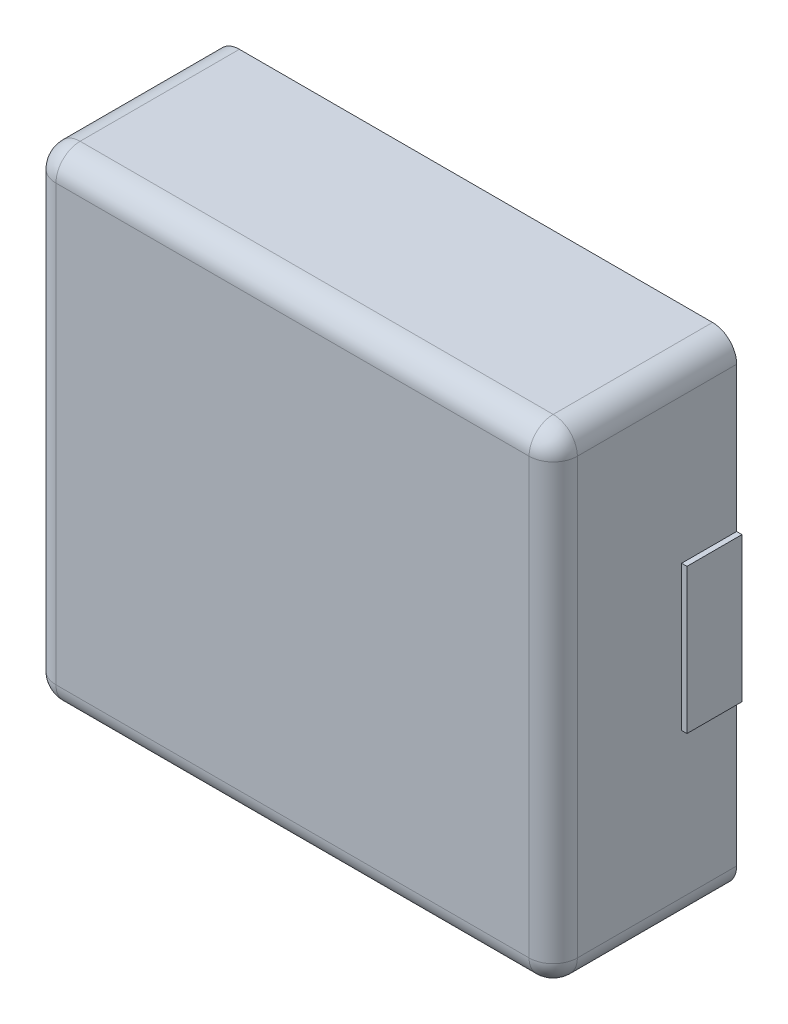
ISO-10303-21;
HEADER;
FILE_DESCRIPTION(('STEP AP214'),'2;1');
FILE_NAME('part.step','',(''),(''),'','','');
FILE_SCHEMA(('AUTOMOTIVE_DESIGN { 1 0 10303 214 1 1 1 1 }'));
ENDSEC;
DATA;
#1=APPLICATION_CONTEXT('core data for automotive mechanical design processes');
#2=APPLICATION_PROTOCOL_DEFINITION('international standard','automotive_design',2000,#1);
#3=PRODUCT_CONTEXT('',#1,'mechanical');
#4=PRODUCT('Part','Part','',(#3));
#5=PRODUCT_RELATED_PRODUCT_CATEGORY('part','',(#4));
#6=PRODUCT_DEFINITION_FORMATION('','',#4);
#7=PRODUCT_DEFINITION_CONTEXT('part definition',#1,'design');
#8=PRODUCT_DEFINITION('design','',#6,#7);
#9=PRODUCT_DEFINITION_SHAPE('','',#8);
#10=(LENGTH_UNIT() NAMED_UNIT(*) SI_UNIT(.MILLI.,.METRE.));
#11=(NAMED_UNIT(*) PLANE_ANGLE_UNIT() SI_UNIT($,.RADIAN.));
#12=(NAMED_UNIT(*) SI_UNIT($,.STERADIAN.) SOLID_ANGLE_UNIT());
#13=UNCERTAINTY_MEASURE_WITH_UNIT(LENGTH_MEASURE(1.E-05),#10,'distance_accuracy_value','');
#14=(GEOMETRIC_REPRESENTATION_CONTEXT(3) GLOBAL_UNCERTAINTY_ASSIGNED_CONTEXT((#13)) GLOBAL_UNIT_ASSIGNED_CONTEXT((#10,
#11,#12)) REPRESENTATION_CONTEXT('',''));
#15=CARTESIAN_POINT('',(0.,0.,0.));
#16=DIRECTION('',(0.,0.,1.));
#17=DIRECTION('',(1.,0.,0.));
#18=AXIS2_PLACEMENT_3D('',#15,#16,#17);
#19=CARTESIAN_POINT('',(4.9,-4.5,3.3));
#20=DIRECTION('',(0.,0.,1.));
#21=DIRECTION('',(1.,0.,0.));
#22=AXIS2_PLACEMENT_3D('',#19,#20,#21);
#23=SPHERICAL_SURFACE('',#22,0.5);
#24=CARTESIAN_POINT('',(4.9,-4.5,3.3));
#25=DIRECTION('',(-1.,0.,0.));
#26=DIRECTION('',(0.,-1.,0.));
#27=AXIS2_PLACEMENT_3D('',#24,#25,#26);
#28=CIRCLE('',#27,0.5);
#29=CARTESIAN_POINT('',(4.9,-5.,3.3));
#30=VERTEX_POINT('',#29);
#31=CARTESIAN_POINT('',(4.9,-4.5,3.8));
#32=VERTEX_POINT('',#31);
#33=EDGE_CURVE('E128',#30,#32,#28,.T.);
#34=ORIENTED_EDGE('',*,*,#33,.F.);
#35=CARTESIAN_POINT('',(4.9,-4.5,3.3));
#36=DIRECTION('',(0.,0.,-1.));
#37=DIRECTION('',(1.,0.,0.));
#38=AXIS2_PLACEMENT_3D('',#35,#36,#37);
#39=CIRCLE('',#38,0.5);
#40=CARTESIAN_POINT('',(5.4,-4.5,3.3));
#41=VERTEX_POINT('',#40);
#42=EDGE_CURVE('E110',#41,#30,#39,.T.);
#43=ORIENTED_EDGE('',*,*,#42,.F.);
#44=CARTESIAN_POINT('',(4.9,-4.5,3.3));
#45=DIRECTION('',(0.,-1.,0.));
#46=DIRECTION('',(1.,0.,0.));
#47=AXIS2_PLACEMENT_3D('',#44,#45,#46);
#48=CIRCLE('',#47,0.5);
#49=EDGE_CURVE('E137',#41,#32,#48,.T.);
#50=ORIENTED_EDGE('',*,*,#49,.T.);
#51=EDGE_LOOP('',(#34,#43,#50));
#52=FACE_BOUND('',#51,.T.);
#53=ADVANCED_FACE('F17',(#52),#23,.T.);
#54=CARTESIAN_POINT('',(5.51,-1.5,0.));
#55=DIRECTION('',(1.,0.,0.));
#56=DIRECTION('',(0.,1.,0.));
#57=AXIS2_PLACEMENT_3D('',#54,#55,#56);
#58=PLANE('',#57);
#59=DIRECTION('',(0.,0.,1.));
#60=VECTOR('',#59,1.);
#61=CARTESIAN_POINT('',(5.51,-1.5,0.));
#62=LINE('',#61,#60);
#63=CARTESIAN_POINT('',(5.51,-1.5,0.));
#64=VERTEX_POINT('',#63);
#65=CARTESIAN_POINT('',(5.51,-1.5,1.14));
#66=VERTEX_POINT('',#65);
#67=EDGE_CURVE('E11',#64,#66,#62,.T.);
#68=ORIENTED_EDGE('',*,*,#67,.F.);
#69=DIRECTION('',(0.,1.,0.));
#70=VECTOR('',#69,1.);
#71=CARTESIAN_POINT('',(5.51,-1.5,0.));
#72=LINE('',#71,#70);
#73=CARTESIAN_POINT('',(5.51,1.5,0.));
#74=VERTEX_POINT('',#73);
#75=EDGE_CURVE('E97',#64,#74,#72,.T.);
#76=ORIENTED_EDGE('',*,*,#75,.T.);
#77=DIRECTION('',(0.,0.,1.));
#78=VECTOR('',#77,1.);
#79=CARTESIAN_POINT('',(5.51,1.5,0.));
#80=LINE('',#79,#78);
#81=CARTESIAN_POINT('',(5.51,1.5,1.14));
#82=VERTEX_POINT('',#81);
#83=EDGE_CURVE('E143',#74,#82,#80,.T.);
#84=ORIENTED_EDGE('',*,*,#83,.T.);
#85=DIRECTION('',(0.,1.,0.));
#86=VECTOR('',#85,1.);
#87=CARTESIAN_POINT('',(5.51,-1.5,1.14));
#88=LINE('',#87,#86);
#89=EDGE_CURVE('E25',#66,#82,#88,.T.);
#90=ORIENTED_EDGE('',*,*,#89,.F.);
#91=EDGE_LOOP('',(#68,#76,#84,#90));
#92=FACE_BOUND('',#91,.T.);
#93=ADVANCED_FACE('F95',(#92),#58,.T.);
#94=CARTESIAN_POINT('',(3.51,-1.5,0.));
#95=DIRECTION('',(0.,1.,0.));
#96=DIRECTION('',(1.,0.,0.));
#97=AXIS2_PLACEMENT_3D('',#94,#95,#96);
#98=PLANE('',#97);
#99=ORIENTED_EDGE('',*,*,#67,.T.);
#100=DIRECTION('',(1.,0.,0.));
#101=VECTOR('',#100,1.);
#102=CARTESIAN_POINT('',(3.51,-1.5,1.14));
#103=LINE('',#102,#101);
#104=CARTESIAN_POINT('',(5.4,-1.5,1.14));
#105=VERTEX_POINT('',#104);
#106=EDGE_CURVE('E141',#105,#66,#103,.T.);
#107=ORIENTED_EDGE('',*,*,#106,.F.);
#108=DIRECTION('',(0.,0.,1.));
#109=VECTOR('',#108,1.);
#110=CARTESIAN_POINT('',(5.4,-1.5,0.));
#111=LINE('',#110,#109);
#112=CARTESIAN_POINT('',(5.4,-1.5,0.));
#113=VERTEX_POINT('',#112);
#114=EDGE_CURVE('E105',#113,#105,#111,.T.);
#115=ORIENTED_EDGE('',*,*,#114,.F.);
#116=DIRECTION('',(1.,0.,0.));
#117=VECTOR('',#116,1.);
#118=CARTESIAN_POINT('',(3.51,-1.5,0.));
#119=LINE('',#118,#117);
#120=EDGE_CURVE('E101',#113,#64,#119,.T.);
#121=ORIENTED_EDGE('',*,*,#120,.T.);
#122=EDGE_LOOP('',(#99,#107,#115,#121));
#123=FACE_BOUND('',#122,.T.);
#124=ADVANCED_FACE('F102',(#123),#98,.F.);
#125=CARTESIAN_POINT('',(3.51,-1.5,1.14));
#126=DIRECTION('',(0.,0.,1.));
#127=DIRECTION('',(1.,0.,0.));
#128=AXIS2_PLACEMENT_3D('',#125,#126,#127);
#129=PLANE('',#128);
#130=DIRECTION('',(0.,-1.,0.));
#131=VECTOR('',#130,1.);
#132=CARTESIAN_POINT('',(5.4,-3.25,1.14));
#133=LINE('',#132,#131);
#134=CARTESIAN_POINT('',(5.4,1.5,1.14));
#135=VERTEX_POINT('',#134);
#136=EDGE_CURVE('E625',#135,#105,#133,.T.);
#137=ORIENTED_EDGE('',*,*,#136,.T.);
#138=ORIENTED_EDGE('',*,*,#106,.T.);
#139=ORIENTED_EDGE('',*,*,#89,.T.);
#140=DIRECTION('',(1.,0.,0.));
#141=VECTOR('',#140,1.);
#142=CARTESIAN_POINT('',(3.51,1.5,1.14));
#143=LINE('',#142,#141);
#144=EDGE_CURVE('E140',#135,#82,#143,.T.);
#145=ORIENTED_EDGE('',*,*,#144,.F.);
#146=EDGE_LOOP('',(#137,#138,#139,#145));
#147=FACE_BOUND('',#146,.T.);
#148=ADVANCED_FACE('F410',(#147),#129,.T.);
#149=CARTESIAN_POINT('',(3.51,1.5,0.));
#150=DIRECTION('',(0.,1.,0.));
#151=DIRECTION('',(1.,0.,0.));
#152=AXIS2_PLACEMENT_3D('',#149,#150,#151);
#153=PLANE('',#152);
#154=DIRECTION('',(1.,0.,0.));
#155=VECTOR('',#154,1.);
#156=CARTESIAN_POINT('',(3.51,1.5,0.));
#157=LINE('',#156,#155);
#158=CARTESIAN_POINT('',(5.4,1.5,0.));
#159=VERTEX_POINT('',#158);
#160=EDGE_CURVE('E115',#159,#74,#157,.T.);
#161=ORIENTED_EDGE('',*,*,#160,.F.);
#162=DIRECTION('',(0.,0.,1.));
#163=VECTOR('',#162,1.);
#164=CARTESIAN_POINT('',(5.4,1.5,0.));
#165=LINE('',#164,#163);
#166=EDGE_CURVE('E120',#159,#135,#165,.T.);
#167=ORIENTED_EDGE('',*,*,#166,.T.);
#168=ORIENTED_EDGE('',*,*,#144,.T.);
#169=ORIENTED_EDGE('',*,*,#83,.F.);
#170=EDGE_LOOP('',(#161,#167,#168,#169));
#171=FACE_BOUND('',#170,.T.);
#172=ADVANCED_FACE('F399',(#171),#153,.T.);
#173=CARTESIAN_POINT('',(4.9,4.5,3.3));
#174=DIRECTION('',(0.,0.,1.));
#175=DIRECTION('',(0.,1.,0.));
#176=AXIS2_PLACEMENT_3D('',#173,#174,#175);
#177=SPHERICAL_SURFACE('',#176,0.5);
#178=CARTESIAN_POINT('',(4.9,4.5,3.3));
#179=DIRECTION('',(0.,-1.,0.));
#180=DIRECTION('',(1.,0.,0.));
#181=AXIS2_PLACEMENT_3D('',#178,#179,#180);
#182=CIRCLE('',#181,0.5);
#183=CARTESIAN_POINT('',(5.4,4.5,3.3));
#184=VERTEX_POINT('',#183);
#185=CARTESIAN_POINT('',(4.9,4.5,3.8));
#186=VERTEX_POINT('',#185);
#187=EDGE_CURVE('E134',#184,#186,#182,.T.);
#188=ORIENTED_EDGE('',*,*,#187,.F.);
#189=CARTESIAN_POINT('',(4.9,4.5,3.3));
#190=DIRECTION('',(0.,0.,-1.));
#191=DIRECTION('',(0.,1.,0.));
#192=AXIS2_PLACEMENT_3D('',#189,#190,#191);
#193=CIRCLE('',#192,0.5);
#194=CARTESIAN_POINT('',(4.9,5.,3.3));
#195=VERTEX_POINT('',#194);
#196=EDGE_CURVE('E764',#195,#184,#193,.T.);
#197=ORIENTED_EDGE('',*,*,#196,.F.);
#198=CARTESIAN_POINT('',(4.9,4.5,3.3));
#199=DIRECTION('',(1.,0.,0.));
#200=DIRECTION('',(0.,1.,0.));
#201=AXIS2_PLACEMENT_3D('',#198,#199,#200);
#202=CIRCLE('',#201,0.5);
#203=EDGE_CURVE('E132',#195,#186,#202,.T.);
#204=ORIENTED_EDGE('',*,*,#203,.T.);
#205=EDGE_LOOP('',(#188,#197,#204));
#206=FACE_BOUND('',#205,.T.);
#207=ADVANCED_FACE('F388',(#206),#177,.T.);
#208=CARTESIAN_POINT('',(4.9,4.5,3.3));
#209=DIRECTION('',(0.,-1.,0.));
#210=DIRECTION('',(1.,0.,0.));
#211=AXIS2_PLACEMENT_3D('',#208,#209,#210);
#212=CYLINDRICAL_SURFACE('',#211,0.5);
#213=ORIENTED_EDGE('',*,*,#187,.T.);
#214=DIRECTION('',(0.,-1.,0.));
#215=VECTOR('',#214,1.);
#216=CARTESIAN_POINT('',(4.9,4.5,3.8));
#217=LINE('',#216,#215);
#218=EDGE_CURVE('E703',#186,#32,#217,.T.);
#219=ORIENTED_EDGE('',*,*,#218,.T.);
#220=ORIENTED_EDGE('',*,*,#49,.F.);
#221=DIRECTION('',(0.,-1.,0.));
#222=VECTOR('',#221,1.);
#223=CARTESIAN_POINT('',(5.4,4.5,3.3));
#224=LINE('',#223,#222);
#225=EDGE_CURVE('E768',#184,#41,#224,.T.);
#226=ORIENTED_EDGE('',*,*,#225,.F.);
#227=EDGE_LOOP('',(#213,#219,#220,#226));
#228=FACE_BOUND('',#227,.T.);
#229=ADVANCED_FACE('F377',(#228),#212,.T.);
#230=CARTESIAN_POINT('',(-4.9,4.5,3.3));
#231=DIRECTION('',(1.,0.,0.));
#232=DIRECTION('',(0.,1.,0.));
#233=AXIS2_PLACEMENT_3D('',#230,#231,#232);
#234=CYLINDRICAL_SURFACE('',#233,0.5);
#235=CARTESIAN_POINT('',(-4.9,4.5,3.3));
#236=DIRECTION('',(1.,0.,0.));
#237=DIRECTION('',(0.,1.,0.));
#238=AXIS2_PLACEMENT_3D('',#235,#236,#237);
#239=CIRCLE('',#238,0.5);
#240=CARTESIAN_POINT('',(-4.9,5.,3.3));
#241=VERTEX_POINT('',#240);
#242=CARTESIAN_POINT('',(-4.9,4.5,3.8));
#243=VERTEX_POINT('',#242);
#244=EDGE_CURVE('E640',#241,#243,#239,.T.);
#245=ORIENTED_EDGE('',*,*,#244,.T.);
#246=DIRECTION('',(1.,0.,0.));
#247=VECTOR('',#246,1.);
#248=CARTESIAN_POINT('',(-4.9,4.5,3.8));
#249=LINE('',#248,#247);
#250=EDGE_CURVE('E699',#243,#186,#249,.T.);
#251=ORIENTED_EDGE('',*,*,#250,.T.);
#252=ORIENTED_EDGE('',*,*,#203,.F.);
#253=DIRECTION('',(1.,0.,0.));
#254=VECTOR('',#253,1.);
#255=CARTESIAN_POINT('',(-4.9,5.,3.3));
#256=LINE('',#255,#254);
#257=EDGE_CURVE('E635',#241,#195,#256,.T.);
#258=ORIENTED_EDGE('',*,*,#257,.F.);
#259=EDGE_LOOP('',(#245,#251,#252,#258));
#260=FACE_BOUND('',#259,.T.);
#261=ADVANCED_FACE('F272',(#260),#234,.T.);
#262=CARTESIAN_POINT('',(4.9,-4.5,3.3));
#263=DIRECTION('',(-1.,0.,0.));
#264=DIRECTION('',(0.,-1.,0.));
#265=AXIS2_PLACEMENT_3D('',#262,#263,#264);
#266=CYLINDRICAL_SURFACE('',#265,0.5);
#267=ORIENTED_EDGE('',*,*,#33,.T.);
#268=DIRECTION('',(-1.,0.,0.));
#269=VECTOR('',#268,1.);
#270=CARTESIAN_POINT('',(4.9,-4.5,3.8));
#271=LINE('',#270,#269);
#272=CARTESIAN_POINT('',(-4.9,-4.5,3.8));
#273=VERTEX_POINT('',#272);
#274=EDGE_CURVE('E718',#32,#273,#271,.T.);
#275=ORIENTED_EDGE('',*,*,#274,.T.);
#276=CARTESIAN_POINT('',(-4.9,-4.5,3.3));
#277=DIRECTION('',(-1.,0.,0.));
#278=DIRECTION('',(0.,-1.,0.));
#279=AXIS2_PLACEMENT_3D('',#276,#277,#278);
#280=CIRCLE('',#279,0.5);
#281=CARTESIAN_POINT('',(-4.9,-5.,3.3));
#282=VERTEX_POINT('',#281);
#283=EDGE_CURVE('E747',#282,#273,#280,.T.);
#284=ORIENTED_EDGE('',*,*,#283,.F.);
#285=DIRECTION('',(-1.,0.,0.));
#286=VECTOR('',#285,1.);
#287=CARTESIAN_POINT('',(4.9,-5.,3.3));
#288=LINE('',#287,#286);
#289=EDGE_CURVE('E133',#30,#282,#288,.T.);
#290=ORIENTED_EDGE('',*,*,#289,.F.);
#291=EDGE_LOOP('',(#267,#275,#284,#290));
#292=FACE_BOUND('',#291,.T.);
#293=ADVANCED_FACE('F267',(#292),#266,.T.);
#294=CARTESIAN_POINT('',(-5.51,-1.5,0.));
#295=DIRECTION('',(1.,0.,0.));
#296=DIRECTION('',(0.,1.,0.));
#297=AXIS2_PLACEMENT_3D('',#294,#295,#296);
#298=PLANE('',#297);
#299=DIRECTION('',(0.,1.,0.));
#300=VECTOR('',#299,1.);
#301=CARTESIAN_POINT('',(-5.51,-1.5,1.14));
#302=LINE('',#301,#300);
#303=CARTESIAN_POINT('',(-5.51,-1.5,1.14));
#304=VERTEX_POINT('',#303);
#305=CARTESIAN_POINT('',(-5.51,1.5,1.14));
#306=VERTEX_POINT('',#305);
#307=EDGE_CURVE('E577',#304,#306,#302,.T.);
#308=ORIENTED_EDGE('',*,*,#307,.T.);
#309=DIRECTION('',(0.,0.,1.));
#310=VECTOR('',#309,1.);
#311=CARTESIAN_POINT('',(-5.51,1.5,0.));
#312=LINE('',#311,#310);
#313=CARTESIAN_POINT('',(-5.51,1.5,0.));
#314=VERTEX_POINT('',#313);
#315=EDGE_CURVE('E599',#314,#306,#312,.T.);
#316=ORIENTED_EDGE('',*,*,#315,.F.);
#317=DIRECTION('',(0.,1.,0.));
#318=VECTOR('',#317,1.);
#319=CARTESIAN_POINT('',(-5.51,-1.5,0.));
#320=LINE('',#319,#318);
#321=CARTESIAN_POINT('',(-5.51,-1.5,0.));
#322=VERTEX_POINT('',#321);
#323=EDGE_CURVE('E579',#322,#314,#320,.T.);
#324=ORIENTED_EDGE('',*,*,#323,.F.);
#325=DIRECTION('',(0.,0.,1.));
#326=VECTOR('',#325,1.);
#327=CARTESIAN_POINT('',(-5.51,-1.5,0.));
#328=LINE('',#327,#326);
#329=EDGE_CURVE('E573',#322,#304,#328,.T.);
#330=ORIENTED_EDGE('',*,*,#329,.T.);
#331=EDGE_LOOP('',(#308,#316,#324,#330));
#332=FACE_BOUND('',#331,.T.);
#333=ADVANCED_FACE('F271',(#332),#298,.F.);
#334=CARTESIAN_POINT('',(-5.4,-5.,0.));
#335=DIRECTION('',(0.,1.,0.));
#336=DIRECTION('',(1.,0.,0.));
#337=AXIS2_PLACEMENT_3D('',#334,#335,#336);
#338=PLANE('',#337);
#339=DIRECTION('',(1.,0.,0.));
#340=VECTOR('',#339,1.);
#341=CARTESIAN_POINT('',(-5.4,-5.,0.));
#342=LINE('',#341,#340);
#343=CARTESIAN_POINT('',(-4.9,-5.,0.));
#344=VERTEX_POINT('',#343);
#345=CARTESIAN_POINT('',(4.9,-5.,0.));
#346=VERTEX_POINT('',#345);
#347=EDGE_CURVE('E725',#344,#346,#342,.T.);
#348=ORIENTED_EDGE('',*,*,#347,.T.);
#349=DIRECTION('',(0.,0.,1.));
#350=VECTOR('',#349,1.);
#351=CARTESIAN_POINT('',(4.9,-5.,0.));
#352=LINE('',#351,#350);
#353=EDGE_CURVE('E127',#346,#30,#352,.T.);
#354=ORIENTED_EDGE('',*,*,#353,.T.);
#355=ORIENTED_EDGE('',*,*,#289,.T.);
#356=DIRECTION('',(0.,0.,1.));
#357=VECTOR('',#356,1.);
#358=CARTESIAN_POINT('',(-4.9,-5.,0.));
#359=LINE('',#358,#357);
#360=EDGE_CURVE('E662',#344,#282,#359,.T.);
#361=ORIENTED_EDGE('',*,*,#360,.F.);
#362=EDGE_LOOP('',(#348,#354,#355,#361));
#363=FACE_BOUND('',#362,.T.);
#364=ADVANCED_FACE('F346',(#363),#338,.F.);
#365=CARTESIAN_POINT('',(4.9,-4.5,0.));
#366=DIRECTION('',(0.,0.,1.));
#367=DIRECTION('',(1.,0.,0.));
#368=AXIS2_PLACEMENT_3D('',#365,#366,#367);
#369=CYLINDRICAL_SURFACE('',#368,0.5);
#370=ORIENTED_EDGE('',*,*,#42,.T.);
#371=ORIENTED_EDGE('',*,*,#353,.F.);
#372=CARTESIAN_POINT('',(4.9,-4.5,0.));
#373=DIRECTION('',(0.,0.,-1.));
#374=DIRECTION('',(0.,-1.,0.));
#375=AXIS2_PLACEMENT_3D('',#372,#373,#374);
#376=CIRCLE('',#375,0.5);
#377=CARTESIAN_POINT('',(5.4,-4.5,0.));
#378=VERTEX_POINT('',#377);
#379=EDGE_CURVE('E721',#378,#346,#376,.T.);
#380=ORIENTED_EDGE('',*,*,#379,.F.);
#381=DIRECTION('',(0.,0.,1.));
#382=VECTOR('',#381,1.);
#383=CARTESIAN_POINT('',(5.4,-4.5,0.));
#384=LINE('',#383,#382);
#385=EDGE_CURVE('E774',#378,#41,#384,.T.);
#386=ORIENTED_EDGE('',*,*,#385,.T.);
#387=EDGE_LOOP('',(#370,#371,#380,#386));
#388=FACE_BOUND('',#387,.T.);
#389=ADVANCED_FACE('F171',(#388),#369,.T.);
#390=CARTESIAN_POINT('',(3.51,-1.5,0.));
#391=DIRECTION('',(0.,0.,1.));
#392=DIRECTION('',(1.,0.,0.));
#393=AXIS2_PLACEMENT_3D('',#390,#391,#392);
#394=PLANE('',#393);
#395=DIRECTION('',(1.,0.,0.));
#396=VECTOR('',#395,1.);
#397=CARTESIAN_POINT('',(3.51,1.5,0.));
#398=LINE('',#397,#396);
#399=CARTESIAN_POINT('',(3.51,1.5,0.));
#400=VERTEX_POINT('',#399);
#401=EDGE_CURVE('E707',#400,#159,#398,.T.);
#402=ORIENTED_EDGE('',*,*,#401,.T.);
#403=ORIENTED_EDGE('',*,*,#160,.T.);
#404=ORIENTED_EDGE('',*,*,#75,.F.);
#405=ORIENTED_EDGE('',*,*,#120,.F.);
#406=DIRECTION('',(1.,0.,0.));
#407=VECTOR('',#406,1.);
#408=CARTESIAN_POINT('',(3.51,-1.5,0.));
#409=LINE('',#408,#407);
#410=CARTESIAN_POINT('',(3.51,-1.5,0.));
#411=VERTEX_POINT('',#410);
#412=EDGE_CURVE('E663',#411,#113,#409,.T.);
#413=ORIENTED_EDGE('',*,*,#412,.F.);
#414=DIRECTION('',(0.,1.,0.));
#415=VECTOR('',#414,1.);
#416=CARTESIAN_POINT('',(3.51,-1.5,0.));
#417=LINE('',#416,#415);
#418=EDGE_CURVE('E668',#411,#400,#417,.T.);
#419=ORIENTED_EDGE('',*,*,#418,.T.);
#420=EDGE_LOOP('',(#402,#403,#404,#405,#413,#419));
#421=FACE_BOUND('',#420,.T.);
#422=ADVANCED_FACE('F113',(#421),#394,.F.);
#423=CARTESIAN_POINT('',(5.4,-5.,0.));
#424=DIRECTION('',(1.,0.,0.));
#425=DIRECTION('',(0.,1.,0.));
#426=AXIS2_PLACEMENT_3D('',#423,#424,#425);
#427=PLANE('',#426);
#428=ORIENTED_EDGE('',*,*,#225,.T.);
#429=ORIENTED_EDGE('',*,*,#385,.F.);
#430=DIRECTION('',(0.,1.,0.));
#431=VECTOR('',#430,1.);
#432=CARTESIAN_POINT('',(5.4,-5.,0.));
#433=LINE('',#432,#431);
#434=EDGE_CURVE('E667',#378,#113,#433,.T.);
#435=ORIENTED_EDGE('',*,*,#434,.T.);
#436=ORIENTED_EDGE('',*,*,#114,.T.);
#437=ORIENTED_EDGE('',*,*,#136,.F.);
#438=ORIENTED_EDGE('',*,*,#166,.F.);
#439=DIRECTION('',(0.,1.,0.));
#440=VECTOR('',#439,1.);
#441=CARTESIAN_POINT('',(5.4,-5.,0.));
#442=LINE('',#441,#440);
#443=CARTESIAN_POINT('',(5.4,4.5,0.));
#444=VERTEX_POINT('',#443);
#445=EDGE_CURVE('E695',#159,#444,#442,.T.);
#446=ORIENTED_EDGE('',*,*,#445,.T.);
#447=DIRECTION('',(0.,0.,1.));
#448=VECTOR('',#447,1.);
#449=CARTESIAN_POINT('',(5.4,4.5,0.));
#450=LINE('',#449,#448);
#451=EDGE_CURVE('E760',#444,#184,#450,.T.);
#452=ORIENTED_EDGE('',*,*,#451,.T.);
#453=EDGE_LOOP('',(#428,#429,#435,#436,#437,#438,#446,#452));
#454=FACE_BOUND('',#453,.T.);
#455=ADVANCED_FACE('F170',(#454),#427,.T.);
#456=CARTESIAN_POINT('',(4.9,4.5,0.));
#457=DIRECTION('',(0.,0.,1.));
#458=DIRECTION('',(1.,0.,0.));
#459=AXIS2_PLACEMENT_3D('',#456,#457,#458);
#460=CYLINDRICAL_SURFACE('',#459,0.5);
#461=ORIENTED_EDGE('',*,*,#451,.F.);
#462=CARTESIAN_POINT('',(4.9,4.5,0.));
#463=DIRECTION('',(0.,0.,1.));
#464=DIRECTION('',(0.,-1.,0.));
#465=AXIS2_PLACEMENT_3D('',#462,#463,#464);
#466=CIRCLE('',#465,0.5);
#467=CARTESIAN_POINT('',(4.9,5.,0.));
#468=VERTEX_POINT('',#467);
#469=EDGE_CURVE('E691',#444,#468,#466,.T.);
#470=ORIENTED_EDGE('',*,*,#469,.T.);
#471=DIRECTION('',(0.,0.,1.));
#472=VECTOR('',#471,1.);
#473=CARTESIAN_POINT('',(4.9,5.,0.));
#474=LINE('',#473,#472);
#475=EDGE_CURVE('E639',#468,#195,#474,.T.);
#476=ORIENTED_EDGE('',*,*,#475,.T.);
#477=ORIENTED_EDGE('',*,*,#196,.T.);
#478=EDGE_LOOP('',(#461,#470,#476,#477));
#479=FACE_BOUND('',#478,.T.);
#480=ADVANCED_FACE('F315',(#479),#460,.T.);
#481=CARTESIAN_POINT('',(-5.51,-1.5,0.));
#482=DIRECTION('',(0.,0.,1.));
#483=DIRECTION('',(1.,0.,0.));
#484=AXIS2_PLACEMENT_3D('',#481,#482,#483);
#485=PLANE('',#484);
#486=DIRECTION('',(1.,0.,0.));
#487=VECTOR('',#486,1.);
#488=CARTESIAN_POINT('',(-5.51,1.5,0.));
#489=LINE('',#488,#487);
#490=CARTESIAN_POINT('',(-5.4,1.5,0.));
#491=VERTEX_POINT('',#490);
#492=EDGE_CURVE('E733',#314,#491,#489,.T.);
#493=ORIENTED_EDGE('',*,*,#492,.T.);
#494=DIRECTION('',(1.,0.,0.));
#495=VECTOR('',#494,1.);
#496=CARTESIAN_POINT('',(-5.51,1.5,0.));
#497=LINE('',#496,#495);
#498=CARTESIAN_POINT('',(-3.51,1.5,0.));
#499=VERTEX_POINT('',#498);
#500=EDGE_CURVE('E610',#491,#499,#497,.T.);
#501=ORIENTED_EDGE('',*,*,#500,.T.);
#502=DIRECTION('',(0.,1.,0.));
#503=VECTOR('',#502,1.);
#504=CARTESIAN_POINT('',(-3.51,-1.5,0.));
#505=LINE('',#504,#503);
#506=CARTESIAN_POINT('',(-3.51,-1.5,0.));
#507=VERTEX_POINT('',#506);
#508=EDGE_CURVE('E606',#507,#499,#505,.T.);
#509=ORIENTED_EDGE('',*,*,#508,.F.);
#510=DIRECTION('',(1.,0.,0.));
#511=VECTOR('',#510,1.);
#512=CARTESIAN_POINT('',(-5.51,-1.5,0.));
#513=LINE('',#512,#511);
#514=CARTESIAN_POINT('',(-5.4,-1.5,0.));
#515=VERTEX_POINT('',#514);
#516=EDGE_CURVE('E611',#515,#507,#513,.T.);
#517=ORIENTED_EDGE('',*,*,#516,.F.);
#518=DIRECTION('',(1.,0.,0.));
#519=VECTOR('',#518,1.);
#520=CARTESIAN_POINT('',(-5.51,-1.5,0.));
#521=LINE('',#520,#519);
#522=EDGE_CURVE('E582',#322,#515,#521,.T.);
#523=ORIENTED_EDGE('',*,*,#522,.F.);
#524=ORIENTED_EDGE('',*,*,#323,.T.);
#525=EDGE_LOOP('',(#493,#501,#509,#517,#523,#524));
#526=FACE_BOUND('',#525,.T.);
#527=ADVANCED_FACE('F304',(#526),#485,.F.);
#528=CARTESIAN_POINT('',(-5.4,5.,0.));
#529=DIRECTION('',(0.,1.,0.));
#530=DIRECTION('',(1.,0.,0.));
#531=AXIS2_PLACEMENT_3D('',#528,#529,#530);
#532=PLANE('',#531);
#533=DIRECTION('',(0.,0.,1.));
#534=VECTOR('',#533,1.);
#535=CARTESIAN_POINT('',(-4.9,5.,0.));
#536=LINE('',#535,#534);
#537=CARTESIAN_POINT('',(-4.9,5.,0.));
#538=VERTEX_POINT('',#537);
#539=EDGE_CURVE('E678',#538,#241,#536,.T.);
#540=ORIENTED_EDGE('',*,*,#539,.T.);
#541=ORIENTED_EDGE('',*,*,#257,.T.);
#542=ORIENTED_EDGE('',*,*,#475,.F.);
#543=DIRECTION('',(1.,0.,0.));
#544=VECTOR('',#543,1.);
#545=CARTESIAN_POINT('',(-5.4,5.,0.));
#546=LINE('',#545,#544);
#547=EDGE_CURVE('E687',#538,#468,#546,.T.);
#548=ORIENTED_EDGE('',*,*,#547,.F.);
#549=EDGE_LOOP('',(#540,#541,#542,#548));
#550=FACE_BOUND('',#549,.T.);
#551=ADVANCED_FACE('F293',(#550),#532,.T.);
#552=CARTESIAN_POINT('',(-4.9,4.5,3.3));
#553=DIRECTION('',(0.,0.,1.));
#554=DIRECTION('',(-1.,0.,0.));
#555=AXIS2_PLACEMENT_3D('',#552,#553,#554);
#556=SPHERICAL_SURFACE('',#555,0.5);
#557=ORIENTED_EDGE('',*,*,#244,.F.);
#558=CARTESIAN_POINT('',(-4.9,4.5,3.3));
#559=DIRECTION('',(0.,0.,-1.));
#560=DIRECTION('',(-1.,0.,0.));
#561=AXIS2_PLACEMENT_3D('',#558,#559,#560);
#562=CIRCLE('',#561,0.5);
#563=CARTESIAN_POINT('',(-5.4,4.5,3.3));
#564=VERTEX_POINT('',#563);
#565=EDGE_CURVE('E652',#564,#241,#562,.T.);
#566=ORIENTED_EDGE('',*,*,#565,.F.);
#567=CARTESIAN_POINT('',(-4.9,4.5,3.3));
#568=DIRECTION('',(0.,1.,0.));
#569=DIRECTION('',(-1.,0.,0.));
#570=AXIS2_PLACEMENT_3D('',#567,#568,#569);
#571=CIRCLE('',#570,0.5);
#572=EDGE_CURVE('E648',#564,#243,#571,.T.);
#573=ORIENTED_EDGE('',*,*,#572,.T.);
#574=EDGE_LOOP('',(#557,#566,#573));
#575=FACE_BOUND('',#574,.T.);
#576=ADVANCED_FACE('F228',(#575),#556,.T.);
#577=CARTESIAN_POINT('',(-5.4,-5.,3.8));
#578=DIRECTION('',(0.,0.,1.));
#579=DIRECTION('',(1.,0.,0.));
#580=AXIS2_PLACEMENT_3D('',#577,#578,#579);
#581=PLANE('',#580);
#582=DIRECTION('',(0.,1.,0.));
#583=VECTOR('',#582,1.);
#584=CARTESIAN_POINT('',(-4.9,-4.5,3.8));
#585=LINE('',#584,#583);
#586=EDGE_CURVE('E616',#273,#243,#585,.T.);
#587=ORIENTED_EDGE('',*,*,#586,.F.);
#588=ORIENTED_EDGE('',*,*,#274,.F.);
#589=ORIENTED_EDGE('',*,*,#218,.F.);
#590=ORIENTED_EDGE('',*,*,#250,.F.);
#591=EDGE_LOOP('',(#587,#588,#589,#590));
#592=FACE_BOUND('',#591,.T.);
#593=ADVANCED_FACE('F224',(#592),#581,.T.);
#594=CARTESIAN_POINT('',(-4.9,-4.5,3.3));
#595=DIRECTION('',(0.,0.,1.));
#596=DIRECTION('',(0.,-1.,0.));
#597=AXIS2_PLACEMENT_3D('',#594,#595,#596);
#598=SPHERICAL_SURFACE('',#597,0.5);
#599=CARTESIAN_POINT('',(-4.9,-4.5,3.3));
#600=DIRECTION('',(0.,1.,0.));
#601=DIRECTION('',(-1.,0.,0.));
#602=AXIS2_PLACEMENT_3D('',#599,#600,#601);
#603=CIRCLE('',#602,0.5);
#604=CARTESIAN_POINT('',(-5.4,-4.5,3.3));
#605=VERTEX_POINT('',#604);
#606=EDGE_CURVE('E612',#605,#273,#603,.T.);
#607=ORIENTED_EDGE('',*,*,#606,.F.);
#608=CARTESIAN_POINT('',(-4.9,-4.5,3.3));
#609=DIRECTION('',(0.,0.,-1.));
#610=DIRECTION('',(0.,-1.,0.));
#611=AXIS2_PLACEMENT_3D('',#608,#609,#610);
#612=CIRCLE('',#611,0.5);
#613=EDGE_CURVE('E744',#282,#605,#612,.T.);
#614=ORIENTED_EDGE('',*,*,#613,.F.);
#615=ORIENTED_EDGE('',*,*,#283,.T.);
#616=EDGE_LOOP('',(#607,#614,#615));
#617=FACE_BOUND('',#616,.T.);
#618=ADVANCED_FACE('F194',(#617),#598,.T.);
#619=CARTESIAN_POINT('',(-4.9,-4.5,0.));
#620=DIRECTION('',(0.,0.,1.));
#621=DIRECTION('',(-1.,0.,0.));
#622=AXIS2_PLACEMENT_3D('',#619,#620,#621);
#623=CYLINDRICAL_SURFACE('',#622,0.5);
#624=DIRECTION('',(0.,0.,1.));
#625=VECTOR('',#624,1.);
#626=CARTESIAN_POINT('',(-5.4,-4.5,0.));
#627=LINE('',#626,#625);
#628=CARTESIAN_POINT('',(-5.4,-4.5,0.));
#629=VERTEX_POINT('',#628);
#630=EDGE_CURVE('E656',#629,#605,#627,.T.);
#631=ORIENTED_EDGE('',*,*,#630,.F.);
#632=CARTESIAN_POINT('',(-4.9,-4.5,0.));
#633=DIRECTION('',(0.,0.,1.));
#634=DIRECTION('',(0.,-1.,0.));
#635=AXIS2_PLACEMENT_3D('',#632,#633,#634);
#636=CIRCLE('',#635,0.5);
#637=EDGE_CURVE('E729',#629,#344,#636,.T.);
#638=ORIENTED_EDGE('',*,*,#637,.T.);
#639=ORIENTED_EDGE('',*,*,#360,.T.);
#640=ORIENTED_EDGE('',*,*,#613,.T.);
#641=EDGE_LOOP('',(#631,#638,#639,#640));
#642=FACE_BOUND('',#641,.T.);
#643=ADVANCED_FACE('F183',(#642),#623,.T.);
#644=CARTESIAN_POINT('',(-5.51,-1.5,0.));
#645=DIRECTION('',(0.,1.,0.));
#646=DIRECTION('',(1.,0.,0.));
#647=AXIS2_PLACEMENT_3D('',#644,#645,#646);
#648=PLANE('',#647);
#649=DIRECTION('',(0.,0.,1.));
#650=VECTOR('',#649,1.);
#651=CARTESIAN_POINT('',(-5.4,-1.5,0.));
#652=LINE('',#651,#650);
#653=CARTESIAN_POINT('',(-5.4,-1.5,1.14));
#654=VERTEX_POINT('',#653);
#655=EDGE_CURVE('E587',#515,#654,#652,.T.);
#656=ORIENTED_EDGE('',*,*,#655,.T.);
#657=DIRECTION('',(1.,0.,0.));
#658=VECTOR('',#657,1.);
#659=CARTESIAN_POINT('',(-5.51,-1.5,1.14));
#660=LINE('',#659,#658);
#661=EDGE_CURVE('E583',#304,#654,#660,.T.);
#662=ORIENTED_EDGE('',*,*,#661,.F.);
#663=ORIENTED_EDGE('',*,*,#329,.F.);
#664=ORIENTED_EDGE('',*,*,#522,.T.);
#665=EDGE_LOOP('',(#656,#662,#663,#664));
#666=FACE_BOUND('',#665,.T.);
#667=ADVANCED_FACE('F178',(#666),#648,.F.);
#668=CARTESIAN_POINT('',(-5.51,-1.5,1.14));
#669=DIRECTION('',(0.,0.,1.));
#670=DIRECTION('',(1.,0.,0.));
#671=AXIS2_PLACEMENT_3D('',#668,#669,#670);
#672=PLANE('',#671);
#673=DIRECTION('',(1.,0.,0.));
#674=VECTOR('',#673,1.);
#675=CARTESIAN_POINT('',(-5.51,1.5,1.14));
#676=LINE('',#675,#674);
#677=CARTESIAN_POINT('',(-5.4,1.5,1.14));
#678=VERTEX_POINT('',#677);
#679=EDGE_CURVE('E592',#306,#678,#676,.T.);
#680=ORIENTED_EDGE('',*,*,#679,.F.);
#681=ORIENTED_EDGE('',*,*,#307,.F.);
#682=ORIENTED_EDGE('',*,*,#661,.T.);
#683=DIRECTION('',(0.,-1.,0.));
#684=VECTOR('',#683,1.);
#685=CARTESIAN_POINT('',(-5.4,-3.25,1.14));
#686=LINE('',#685,#684);
#687=EDGE_CURVE('E629',#678,#654,#686,.T.);
#688=ORIENTED_EDGE('',*,*,#687,.F.);
#689=EDGE_LOOP('',(#680,#681,#682,#688));
#690=FACE_BOUND('',#689,.T.);
#691=ADVANCED_FACE('F182',(#690),#672,.T.);
#692=CARTESIAN_POINT('',(-5.51,1.5,0.));
#693=DIRECTION('',(0.,1.,0.));
#694=DIRECTION('',(1.,0.,0.));
#695=AXIS2_PLACEMENT_3D('',#692,#693,#694);
#696=PLANE('',#695);
#697=ORIENTED_EDGE('',*,*,#492,.F.);
#698=ORIENTED_EDGE('',*,*,#315,.T.);
#699=ORIENTED_EDGE('',*,*,#679,.T.);
#700=DIRECTION('',(0.,0.,1.));
#701=VECTOR('',#700,1.);
#702=CARTESIAN_POINT('',(-5.4,1.5,0.));
#703=LINE('',#702,#701);
#704=EDGE_CURVE('E621',#491,#678,#703,.T.);
#705=ORIENTED_EDGE('',*,*,#704,.F.);
#706=EDGE_LOOP('',(#697,#698,#699,#705));
#707=FACE_BOUND('',#706,.T.);
#708=ADVANCED_FACE('F239',(#707),#696,.T.);
#709=CARTESIAN_POINT('',(-5.4,-5.,0.));
#710=DIRECTION('',(0.,0.,1.));
#711=DIRECTION('',(1.,0.,0.));
#712=AXIS2_PLACEMENT_3D('',#709,#710,#711);
#713=PLANE('',#712);
#714=ORIENTED_EDGE('',*,*,#516,.T.);
#715=ORIENTED_EDGE('',*,*,#508,.T.);
#716=ORIENTED_EDGE('',*,*,#500,.F.);
#717=DIRECTION('',(0.,1.,0.));
#718=VECTOR('',#717,1.);
#719=CARTESIAN_POINT('',(-5.4,-5.,0.));
#720=LINE('',#719,#718);
#721=CARTESIAN_POINT('',(-5.4,4.5,0.));
#722=VERTEX_POINT('',#721);
#723=EDGE_CURVE('E605',#491,#722,#720,.T.);
#724=ORIENTED_EDGE('',*,*,#723,.T.);
#725=CARTESIAN_POINT('',(-4.9,4.5,0.));
#726=DIRECTION('',(0.,0.,-1.));
#727=DIRECTION('',(0.,-1.,0.));
#728=AXIS2_PLACEMENT_3D('',#725,#726,#727);
#729=CIRCLE('',#728,0.5);
#730=EDGE_CURVE('E644',#722,#538,#729,.T.);
#731=ORIENTED_EDGE('',*,*,#730,.T.);
#732=ORIENTED_EDGE('',*,*,#547,.T.);
#733=ORIENTED_EDGE('',*,*,#469,.F.);
#734=ORIENTED_EDGE('',*,*,#445,.F.);
#735=ORIENTED_EDGE('',*,*,#401,.F.);
#736=ORIENTED_EDGE('',*,*,#418,.F.);
#737=ORIENTED_EDGE('',*,*,#412,.T.);
#738=ORIENTED_EDGE('',*,*,#434,.F.);
#739=ORIENTED_EDGE('',*,*,#379,.T.);
#740=ORIENTED_EDGE('',*,*,#347,.F.);
#741=ORIENTED_EDGE('',*,*,#637,.F.);
#742=DIRECTION('',(0.,1.,0.));
#743=VECTOR('',#742,1.);
#744=CARTESIAN_POINT('',(-5.4,-5.,0.));
#745=LINE('',#744,#743);
#746=EDGE_CURVE('E647',#629,#515,#745,.T.);
#747=ORIENTED_EDGE('',*,*,#746,.T.);
#748=EDGE_LOOP('',(#714,#715,#716,#724,#731,#732,#733,#734,#735,#736,#737,#738,#739,#740,#741,#747));
#749=FACE_BOUND('',#748,.T.);
#750=ADVANCED_FACE('F216',(#749),#713,.F.);
#751=CARTESIAN_POINT('',(-4.9,4.5,0.));
#752=DIRECTION('',(0.,0.,1.));
#753=DIRECTION('',(-1.,0.,0.));
#754=AXIS2_PLACEMENT_3D('',#751,#752,#753);
#755=CYLINDRICAL_SURFACE('',#754,0.5);
#756=ORIENTED_EDGE('',*,*,#565,.T.);
#757=ORIENTED_EDGE('',*,*,#539,.F.);
#758=ORIENTED_EDGE('',*,*,#730,.F.);
#759=DIRECTION('',(0.,0.,1.));
#760=VECTOR('',#759,1.);
#761=CARTESIAN_POINT('',(-5.4,4.5,0.));
#762=LINE('',#761,#760);
#763=EDGE_CURVE('E602',#722,#564,#762,.T.);
#764=ORIENTED_EDGE('',*,*,#763,.T.);
#765=EDGE_LOOP('',(#756,#757,#758,#764));
#766=FACE_BOUND('',#765,.T.);
#767=ADVANCED_FACE('F205',(#766),#755,.T.);
#768=CARTESIAN_POINT('',(-4.9,-4.5,3.3));
#769=DIRECTION('',(0.,1.,0.));
#770=DIRECTION('',(-1.,0.,0.));
#771=AXIS2_PLACEMENT_3D('',#768,#769,#770);
#772=CYLINDRICAL_SURFACE('',#771,0.5);
#773=ORIENTED_EDGE('',*,*,#606,.T.);
#774=ORIENTED_EDGE('',*,*,#586,.T.);
#775=ORIENTED_EDGE('',*,*,#572,.F.);
#776=DIRECTION('',(0.,1.,0.));
#777=VECTOR('',#776,1.);
#778=CARTESIAN_POINT('',(-5.4,-4.5,3.3));
#779=LINE('',#778,#777);
#780=EDGE_CURVE('E617',#605,#564,#779,.T.);
#781=ORIENTED_EDGE('',*,*,#780,.F.);
#782=EDGE_LOOP('',(#773,#774,#775,#781));
#783=FACE_BOUND('',#782,.T.);
#784=ADVANCED_FACE('F157',(#783),#772,.T.);
#785=CARTESIAN_POINT('',(-5.4,-5.,0.));
#786=DIRECTION('',(1.,0.,0.));
#787=DIRECTION('',(0.,1.,0.));
#788=AXIS2_PLACEMENT_3D('',#785,#786,#787);
#789=PLANE('',#788);
#790=ORIENTED_EDGE('',*,*,#763,.F.);
#791=ORIENTED_EDGE('',*,*,#723,.F.);
#792=ORIENTED_EDGE('',*,*,#704,.T.);
#793=ORIENTED_EDGE('',*,*,#687,.T.);
#794=ORIENTED_EDGE('',*,*,#655,.F.);
#795=ORIENTED_EDGE('',*,*,#746,.F.);
#796=ORIENTED_EDGE('',*,*,#630,.T.);
#797=ORIENTED_EDGE('',*,*,#780,.T.);
#798=EDGE_LOOP('',(#790,#791,#792,#793,#794,#795,#796,#797));
#799=FACE_BOUND('',#798,.T.);
#800=ADVANCED_FACE('F151',(#799),#789,.F.);
#801=CLOSED_SHELL('',(#53,#93,#124,#148,#172,#207,#229,#261,#293,#333,#364,#389,#422,#455,#480,
#527,#551,#576,#593,#618,#643,#667,#691,#708,#750,#767,#784,#800));
#802=MANIFOLD_SOLID_BREP('B1',#801);
#803=ADVANCED_BREP_SHAPE_REPRESENTATION('',(#18,#802),#14);
#804=SHAPE_DEFINITION_REPRESENTATION(#9,#803);
ENDSEC;
END-ISO-10303-21;
